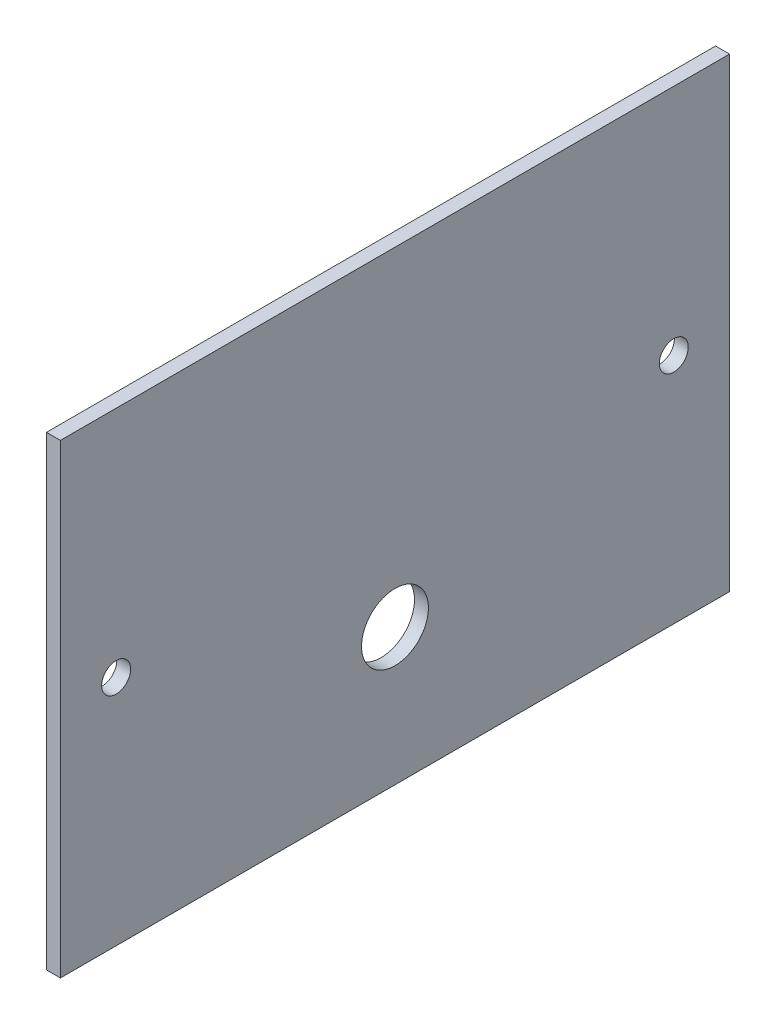
ISO-10303-21;
HEADER;
FILE_DESCRIPTION(('STEP AP214'),'2;1');
FILE_NAME('part.step','',(''),(''),'','','');
FILE_SCHEMA(('AUTOMOTIVE_DESIGN { 1 0 10303 214 1 1 1 1 }'));
ENDSEC;
DATA;
#1=APPLICATION_CONTEXT('core data for automotive mechanical design processes');
#2=APPLICATION_PROTOCOL_DEFINITION('international standard','automotive_design',2000,#1);
#3=PRODUCT_CONTEXT('',#1,'mechanical');
#4=PRODUCT('Part','Part','',(#3));
#5=PRODUCT_RELATED_PRODUCT_CATEGORY('part','',(#4));
#6=PRODUCT_DEFINITION_FORMATION('','',#4);
#7=PRODUCT_DEFINITION_CONTEXT('part definition',#1,'design');
#8=PRODUCT_DEFINITION('design','',#6,#7);
#9=PRODUCT_DEFINITION_SHAPE('','',#8);
#10=(LENGTH_UNIT() NAMED_UNIT(*) SI_UNIT(.MILLI.,.METRE.));
#11=(NAMED_UNIT(*) PLANE_ANGLE_UNIT() SI_UNIT($,.RADIAN.));
#12=(NAMED_UNIT(*) SI_UNIT($,.STERADIAN.) SOLID_ANGLE_UNIT());
#13=UNCERTAINTY_MEASURE_WITH_UNIT(LENGTH_MEASURE(1.E-05),#10,'distance_accuracy_value','');
#14=(GEOMETRIC_REPRESENTATION_CONTEXT(3) GLOBAL_UNCERTAINTY_ASSIGNED_CONTEXT((#13)) GLOBAL_UNIT_ASSIGNED_CONTEXT((#10,
#11,#12)) REPRESENTATION_CONTEXT('',''));
#15=CARTESIAN_POINT('',(0.,0.,0.));
#16=DIRECTION('',(0.,0.,1.));
#17=DIRECTION('',(1.,0.,0.));
#18=AXIS2_PLACEMENT_3D('',#15,#16,#17);
#19=CARTESIAN_POINT('',(3.175,0.,0.));
#20=DIRECTION('',(0.,0.,-1.));
#21=DIRECTION('',(-1.,0.,0.));
#22=AXIS2_PLACEMENT_3D('',#19,#20,#21);
#23=PLANE('',#22);
#24=DIRECTION('',(0.,-1.,0.));
#25=VECTOR('',#24,1.);
#26=CARTESIAN_POINT('',(0.,0.,0.));
#27=LINE('',#26,#25);
#28=CARTESIAN_POINT('',(0.,106.045,0.));
#29=VERTEX_POINT('',#28);
#30=CARTESIAN_POINT('',(0.,0.,0.));
#31=VERTEX_POINT('',#30);
#32=EDGE_CURVE('E96',#29,#31,#27,.T.);
#33=ORIENTED_EDGE('',*,*,#32,.T.);
#34=DIRECTION('',(-1.,0.,0.));
#35=VECTOR('',#34,1.);
#36=CARTESIAN_POINT('',(3.175,0.,0.));
#37=LINE('',#36,#35);
#38=CARTESIAN_POINT('',(3.175,0.,0.));
#39=VERTEX_POINT('',#38);
#40=EDGE_CURVE('E11',#39,#31,#37,.T.);
#41=ORIENTED_EDGE('',*,*,#40,.F.);
#42=DIRECTION('',(0.,-1.,0.));
#43=VECTOR('',#42,1.);
#44=CARTESIAN_POINT('',(3.175,0.,0.));
#45=LINE('',#44,#43);
#46=CARTESIAN_POINT('',(3.175,106.045,0.));
#47=VERTEX_POINT('',#46);
#48=EDGE_CURVE('E84',#47,#39,#45,.T.);
#49=ORIENTED_EDGE('',*,*,#48,.F.);
#50=DIRECTION('',(-1.,0.,0.));
#51=VECTOR('',#50,1.);
#52=CARTESIAN_POINT('',(3.175,106.045,0.));
#53=LINE('',#52,#51);
#54=EDGE_CURVE('E92',#47,#29,#53,.T.);
#55=ORIENTED_EDGE('',*,*,#54,.T.);
#56=EDGE_LOOP('',(#33,#41,#49,#55));
#57=FACE_BOUND('',#56,.T.);
#58=ADVANCED_FACE('F33',(#57),#23,.F.);
#59=CARTESIAN_POINT('',(3.175,0.,0.));
#60=DIRECTION('',(0.,1.,0.));
#61=DIRECTION('',(0.,0.,1.));
#62=AXIS2_PLACEMENT_3D('',#59,#60,#61);
#63=PLANE('',#62);
#64=DIRECTION('',(0.,0.,-1.));
#65=VECTOR('',#64,1.);
#66=CARTESIAN_POINT('',(0.,0.,0.));
#67=LINE('',#66,#65);
#68=CARTESIAN_POINT('',(0.,0.,-152.4));
#69=VERTEX_POINT('',#68);
#70=EDGE_CURVE('E88',#31,#69,#67,.T.);
#71=ORIENTED_EDGE('',*,*,#70,.T.);
#72=DIRECTION('',(-1.,0.,0.));
#73=VECTOR('',#72,1.);
#74=CARTESIAN_POINT('',(3.175,0.,-152.4));
#75=LINE('',#74,#73);
#76=CARTESIAN_POINT('',(3.175,0.,-152.4));
#77=VERTEX_POINT('',#76);
#78=EDGE_CURVE('E41',#77,#69,#75,.T.);
#79=ORIENTED_EDGE('',*,*,#78,.F.);
#80=DIRECTION('',(0.,0.,-1.));
#81=VECTOR('',#80,1.);
#82=CARTESIAN_POINT('',(3.175,0.,0.));
#83=LINE('',#82,#81);
#84=EDGE_CURVE('E79',#39,#77,#83,.T.);
#85=ORIENTED_EDGE('',*,*,#84,.F.);
#86=ORIENTED_EDGE('',*,*,#40,.T.);
#87=EDGE_LOOP('',(#71,#79,#85,#86));
#88=FACE_BOUND('',#87,.T.);
#89=ADVANCED_FACE('F87',(#88),#63,.F.);
#90=CARTESIAN_POINT('',(3.175,0.,-152.4));
#91=DIRECTION('',(0.,0.,1.));
#92=DIRECTION('',(1.,0.,0.));
#93=AXIS2_PLACEMENT_3D('',#90,#91,#92);
#94=PLANE('',#93);
#95=DIRECTION('',(0.,1.,0.));
#96=VECTOR('',#95,1.);
#97=CARTESIAN_POINT('',(0.,0.,-152.4));
#98=LINE('',#97,#96);
#99=CARTESIAN_POINT('',(0.,106.045,-152.4));
#100=VERTEX_POINT('',#99);
#101=EDGE_CURVE('E66',#69,#100,#98,.T.);
#102=ORIENTED_EDGE('',*,*,#101,.T.);
#103=DIRECTION('',(-1.,0.,0.));
#104=VECTOR('',#103,1.);
#105=CARTESIAN_POINT('',(3.175,106.045,-152.4));
#106=LINE('',#105,#104);
#107=CARTESIAN_POINT('',(3.175,106.045,-152.4));
#108=VERTEX_POINT('',#107);
#109=EDGE_CURVE('E89',#108,#100,#106,.T.);
#110=ORIENTED_EDGE('',*,*,#109,.F.);
#111=DIRECTION('',(0.,1.,0.));
#112=VECTOR('',#111,1.);
#113=CARTESIAN_POINT('',(3.175,0.,-152.4));
#114=LINE('',#113,#112);
#115=EDGE_CURVE('E82',#77,#108,#114,.T.);
#116=ORIENTED_EDGE('',*,*,#115,.F.);
#117=ORIENTED_EDGE('',*,*,#78,.T.);
#118=EDGE_LOOP('',(#102,#110,#116,#117));
#119=FACE_BOUND('',#118,.T.);
#120=ADVANCED_FACE('F90',(#119),#94,.F.);
#121=CARTESIAN_POINT('',(3.175,106.045,0.));
#122=DIRECTION('',(0.,-1.,0.));
#123=DIRECTION('',(0.,0.,-1.));
#124=AXIS2_PLACEMENT_3D('',#121,#122,#123);
#125=PLANE('',#124);
#126=DIRECTION('',(0.,0.,1.));
#127=VECTOR('',#126,1.);
#128=CARTESIAN_POINT('',(0.,106.045,0.));
#129=LINE('',#128,#127);
#130=EDGE_CURVE('E72',#100,#29,#129,.T.);
#131=ORIENTED_EDGE('',*,*,#130,.T.);
#132=ORIENTED_EDGE('',*,*,#54,.F.);
#133=DIRECTION('',(0.,0.,1.));
#134=VECTOR('',#133,1.);
#135=CARTESIAN_POINT('',(3.175,106.045,0.));
#136=LINE('',#135,#134);
#137=EDGE_CURVE('E49',#108,#47,#136,.T.);
#138=ORIENTED_EDGE('',*,*,#137,.F.);
#139=ORIENTED_EDGE('',*,*,#109,.T.);
#140=EDGE_LOOP('',(#131,#132,#138,#139));
#141=FACE_BOUND('',#140,.T.);
#142=ADVANCED_FACE('F104',(#141),#125,.F.);
#143=CARTESIAN_POINT('',(3.175,0.,0.));
#144=DIRECTION('',(-1.,0.,0.));
#145=DIRECTION('',(0.,0.,1.));
#146=AXIS2_PLACEMENT_3D('',#143,#144,#145);
#147=PLANE('',#146);
#148=CARTESIAN_POINT('',(3.175,52.9589999999999,-139.7));
#149=DIRECTION('',(1.,0.,0.));
#150=DIRECTION('',(0.,0.,1.));
#151=AXIS2_PLACEMENT_3D('',#148,#149,#150);
#152=CIRCLE('',#151,3.30200000000001);
#153=CARTESIAN_POINT('',(3.175,52.9589999999999,-136.398));
#154=VERTEX_POINT('',#153);
#155=EDGE_CURVE('E122',#154,#154,#152,.T.);
#156=ORIENTED_EDGE('',*,*,#155,.F.);
#157=EDGE_LOOP('',(#156));
#158=FACE_BOUND('',#157,.T.);
#159=CARTESIAN_POINT('',(3.175,52.959,-12.7));
#160=DIRECTION('',(1.,0.,0.));
#161=DIRECTION('',(0.,0.,-1.));
#162=AXIS2_PLACEMENT_3D('',#159,#160,#161);
#163=CIRCLE('',#162,3.30199999999999);
#164=CARTESIAN_POINT('',(3.175,52.959,-16.002));
#165=VERTEX_POINT('',#164);
#166=EDGE_CURVE('E116',#165,#165,#163,.T.);
#167=ORIENTED_EDGE('',*,*,#166,.F.);
#168=EDGE_LOOP('',(#167));
#169=FACE_BOUND('',#168,.T.);
#170=CARTESIAN_POINT('',(3.175,31.115,-76.2));
#171=DIRECTION('',(1.,0.,0.));
#172=DIRECTION('',(0.,0.,-1.));
#173=AXIS2_PLACEMENT_3D('',#170,#171,#172);
#174=CIRCLE('',#173,7.62);
#175=CARTESIAN_POINT('',(3.175,31.115,-83.82));
#176=VERTEX_POINT('',#175);
#177=EDGE_CURVE('E110',#176,#176,#174,.T.);
#178=ORIENTED_EDGE('',*,*,#177,.F.);
#179=EDGE_LOOP('',(#178));
#180=FACE_BOUND('',#179,.T.);
#181=ORIENTED_EDGE('',*,*,#48,.T.);
#182=ORIENTED_EDGE('',*,*,#84,.T.);
#183=ORIENTED_EDGE('',*,*,#115,.T.);
#184=ORIENTED_EDGE('',*,*,#137,.T.);
#185=EDGE_LOOP('',(#181,#182,#183,#184));
#186=FACE_BOUND('',#185,.T.);
#187=ADVANCED_FACE('F80',(#158,#169,#180,#186),#147,.F.);
#188=CARTESIAN_POINT('',(0.,0.,0.));
#189=DIRECTION('',(-1.,0.,0.));
#190=DIRECTION('',(0.,0.,1.));
#191=AXIS2_PLACEMENT_3D('',#188,#189,#190);
#192=PLANE('',#191);
#193=CARTESIAN_POINT('',(0.,52.9589999999999,-139.7));
#194=DIRECTION('',(1.,0.,0.));
#195=DIRECTION('',(0.,0.,1.));
#196=AXIS2_PLACEMENT_3D('',#193,#194,#195);
#197=CIRCLE('',#196,3.30200000000001);
#198=CARTESIAN_POINT('',(0.,52.9589999999999,-136.398));
#199=VERTEX_POINT('',#198);
#200=EDGE_CURVE('E119',#199,#199,#197,.T.);
#201=ORIENTED_EDGE('',*,*,#200,.T.);
#202=EDGE_LOOP('',(#201));
#203=FACE_BOUND('',#202,.T.);
#204=CARTESIAN_POINT('',(0.,52.959,-12.7));
#205=DIRECTION('',(1.,0.,0.));
#206=DIRECTION('',(0.,0.,-1.));
#207=AXIS2_PLACEMENT_3D('',#204,#205,#206);
#208=CIRCLE('',#207,3.30199999999999);
#209=CARTESIAN_POINT('',(0.,52.959,-16.002));
#210=VERTEX_POINT('',#209);
#211=EDGE_CURVE('E113',#210,#210,#208,.T.);
#212=ORIENTED_EDGE('',*,*,#211,.T.);
#213=EDGE_LOOP('',(#212));
#214=FACE_BOUND('',#213,.T.);
#215=CARTESIAN_POINT('',(0.,31.115,-76.2));
#216=DIRECTION('',(1.,0.,0.));
#217=DIRECTION('',(0.,0.,-1.));
#218=AXIS2_PLACEMENT_3D('',#215,#216,#217);
#219=CIRCLE('',#218,7.62);
#220=CARTESIAN_POINT('',(0.,31.115,-83.82));
#221=VERTEX_POINT('',#220);
#222=EDGE_CURVE('E99',#221,#221,#219,.T.);
#223=ORIENTED_EDGE('',*,*,#222,.T.);
#224=EDGE_LOOP('',(#223));
#225=FACE_BOUND('',#224,.T.);
#226=ORIENTED_EDGE('',*,*,#32,.F.);
#227=ORIENTED_EDGE('',*,*,#130,.F.);
#228=ORIENTED_EDGE('',*,*,#101,.F.);
#229=ORIENTED_EDGE('',*,*,#70,.F.);
#230=EDGE_LOOP('',(#226,#227,#228,#229));
#231=FACE_BOUND('',#230,.T.);
#232=ADVANCED_FACE('F107',(#203,#214,#225,#231),#192,.T.);
#233=CARTESIAN_POINT('',(0.,31.115,-76.2));
#234=DIRECTION('',(1.,0.,0.));
#235=DIRECTION('',(0.,0.,-1.));
#236=AXIS2_PLACEMENT_3D('',#233,#234,#235);
#237=CYLINDRICAL_SURFACE('',#236,7.62);
#238=ORIENTED_EDGE('',*,*,#222,.F.);
#239=EDGE_LOOP('',(#238));
#240=FACE_BOUND('',#239,.T.);
#241=ORIENTED_EDGE('',*,*,#177,.T.);
#242=EDGE_LOOP('',(#241));
#243=FACE_BOUND('',#242,.T.);
#244=ADVANCED_FACE('F144',(#240,#243),#237,.F.);
#245=CARTESIAN_POINT('',(0.,52.959,-12.7));
#246=DIRECTION('',(1.,0.,0.));
#247=DIRECTION('',(0.,0.,-1.));
#248=AXIS2_PLACEMENT_3D('',#245,#246,#247);
#249=CYLINDRICAL_SURFACE('',#248,3.30199999999999);
#250=ORIENTED_EDGE('',*,*,#211,.F.);
#251=EDGE_LOOP('',(#250));
#252=FACE_BOUND('',#251,.T.);
#253=ORIENTED_EDGE('',*,*,#166,.T.);
#254=EDGE_LOOP('',(#253));
#255=FACE_BOUND('',#254,.T.);
#256=ADVANCED_FACE('F133',(#252,#255),#249,.F.);
#257=CARTESIAN_POINT('',(0.,52.9589999999999,-139.7));
#258=DIRECTION('',(1.,0.,0.));
#259=DIRECTION('',(0.,0.,-1.));
#260=AXIS2_PLACEMENT_3D('',#257,#258,#259);
#261=CYLINDRICAL_SURFACE('',#260,3.30200000000001);
#262=ORIENTED_EDGE('',*,*,#200,.F.);
#263=EDGE_LOOP('',(#262));
#264=FACE_BOUND('',#263,.T.);
#265=ORIENTED_EDGE('',*,*,#155,.T.);
#266=EDGE_LOOP('',(#265));
#267=FACE_BOUND('',#266,.T.);
#268=ADVANCED_FACE('F130',(#264,#267),#261,.F.);
#269=CLOSED_SHELL('',(#58,#89,#120,#142,#187,#232,#244,#256,#268));
#270=MANIFOLD_SOLID_BREP('B2',#269);
#271=ADVANCED_BREP_SHAPE_REPRESENTATION('',(#18,#270),#14);
#272=SHAPE_DEFINITION_REPRESENTATION(#9,#271);
ENDSEC;
END-ISO-10303-21;
